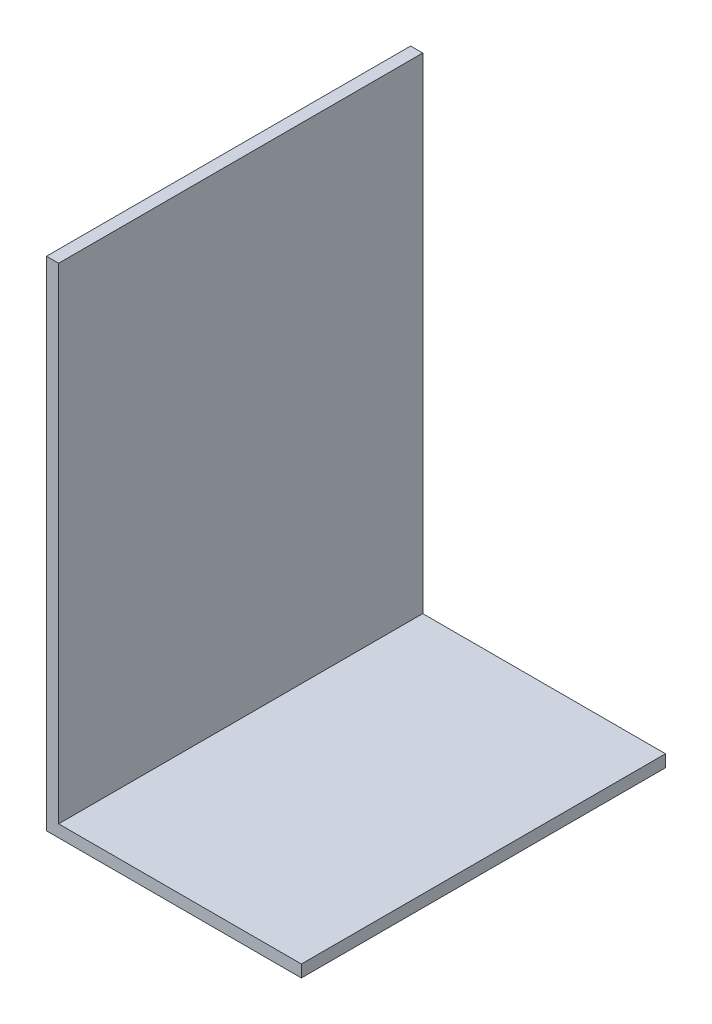
ISO-10303-21;
HEADER;
FILE_DESCRIPTION(('STEP AP214'),'2;1');
FILE_NAME('part.step','',(''),(''),'','','');
FILE_SCHEMA(('AUTOMOTIVE_DESIGN { 1 0 10303 214 1 1 1 1 }'));
ENDSEC;
DATA;
#1=APPLICATION_CONTEXT('core data for automotive mechanical design processes');
#2=APPLICATION_PROTOCOL_DEFINITION('international standard','automotive_design',2000,#1);
#3=PRODUCT_CONTEXT('',#1,'mechanical');
#4=PRODUCT('Part','Part','',(#3));
#5=PRODUCT_RELATED_PRODUCT_CATEGORY('part','',(#4));
#6=PRODUCT_DEFINITION_FORMATION('','',#4);
#7=PRODUCT_DEFINITION_CONTEXT('part definition',#1,'design');
#8=PRODUCT_DEFINITION('design','',#6,#7);
#9=PRODUCT_DEFINITION_SHAPE('','',#8);
#10=(LENGTH_UNIT() NAMED_UNIT(*) SI_UNIT(.MILLI.,.METRE.));
#11=(NAMED_UNIT(*) PLANE_ANGLE_UNIT() SI_UNIT($,.RADIAN.));
#12=(NAMED_UNIT(*) SI_UNIT($,.STERADIAN.) SOLID_ANGLE_UNIT());
#13=UNCERTAINTY_MEASURE_WITH_UNIT(LENGTH_MEASURE(1.E-05),#10,'distance_accuracy_value','');
#14=(GEOMETRIC_REPRESENTATION_CONTEXT(3) GLOBAL_UNCERTAINTY_ASSIGNED_CONTEXT((#13)) GLOBAL_UNIT_ASSIGNED_CONTEXT((#10,
#11,#12)) REPRESENTATION_CONTEXT('',''));
#15=CARTESIAN_POINT('',(0.,0.,0.));
#16=DIRECTION('',(0.,0.,1.));
#17=DIRECTION('',(1.,0.,0.));
#18=AXIS2_PLACEMENT_3D('',#15,#16,#17);
#19=CARTESIAN_POINT('',(0.,-1.,15.));
#20=DIRECTION('',(0.,1.,0.));
#21=DIRECTION('',(0.,0.,1.));
#22=AXIS2_PLACEMENT_3D('',#19,#20,#21);
#23=PLANE('',#22);
#24=DIRECTION('',(1.,0.,0.));
#25=VECTOR('',#24,1.);
#26=CARTESIAN_POINT('',(0.,-1.,-15.));
#27=LINE('',#26,#25);
#28=CARTESIAN_POINT('',(-1.,-1.,-15.));
#29=VERTEX_POINT('',#28);
#30=CARTESIAN_POINT('',(20.,-1.,-15.));
#31=VERTEX_POINT('',#30);
#32=EDGE_CURVE('E114',#29,#31,#27,.T.);
#33=ORIENTED_EDGE('',*,*,#32,.T.);
#34=DIRECTION('',(0.,0.,-1.));
#35=VECTOR('',#34,1.);
#36=CARTESIAN_POINT('',(20.,-1.,15.));
#37=LINE('',#36,#35);
#38=CARTESIAN_POINT('',(20.,-1.,15.));
#39=VERTEX_POINT('',#38);
#40=EDGE_CURVE('E11',#39,#31,#37,.T.);
#41=ORIENTED_EDGE('',*,*,#40,.F.);
#42=DIRECTION('',(1.,0.,0.));
#43=VECTOR('',#42,1.);
#44=CARTESIAN_POINT('',(0.,-1.,15.));
#45=LINE('',#44,#43);
#46=CARTESIAN_POINT('',(-1.,-1.,15.));
#47=VERTEX_POINT('',#46);
#48=EDGE_CURVE('E79',#47,#39,#45,.T.);
#49=ORIENTED_EDGE('',*,*,#48,.F.);
#50=DIRECTION('',(0.,0.,-1.));
#51=VECTOR('',#50,1.);
#52=CARTESIAN_POINT('',(-1.,-1.,15.));
#53=LINE('',#52,#51);
#54=EDGE_CURVE('E110',#47,#29,#53,.T.);
#55=ORIENTED_EDGE('',*,*,#54,.T.);
#56=EDGE_LOOP('',(#33,#41,#49,#55));
#57=FACE_BOUND('',#56,.T.);
#58=ADVANCED_FACE('F33',(#57),#23,.F.);
#59=CARTESIAN_POINT('',(20.,0.,15.));
#60=DIRECTION('',(1.,0.,0.));
#61=DIRECTION('',(0.,0.,-1.));
#62=AXIS2_PLACEMENT_3D('',#59,#60,#61);
#63=PLANE('',#62);
#64=DIRECTION('',(0.,-1.,0.));
#65=VECTOR('',#64,1.);
#66=CARTESIAN_POINT('',(20.,0.,-15.));
#67=LINE('',#66,#65);
#68=CARTESIAN_POINT('',(20.,0.,-15.));
#69=VERTEX_POINT('',#68);
#70=EDGE_CURVE('E117',#69,#31,#67,.T.);
#71=ORIENTED_EDGE('',*,*,#70,.F.);
#72=DIRECTION('',(0.,0.,-1.));
#73=VECTOR('',#72,1.);
#74=CARTESIAN_POINT('',(20.,0.,15.));
#75=LINE('',#74,#73);
#76=CARTESIAN_POINT('',(20.,0.,15.));
#77=VERTEX_POINT('',#76);
#78=EDGE_CURVE('E41',#77,#69,#75,.T.);
#79=ORIENTED_EDGE('',*,*,#78,.F.);
#80=DIRECTION('',(0.,-1.,0.));
#81=VECTOR('',#80,1.);
#82=CARTESIAN_POINT('',(20.,0.,15.));
#83=LINE('',#82,#81);
#84=EDGE_CURVE('E203',#77,#39,#83,.T.);
#85=ORIENTED_EDGE('',*,*,#84,.T.);
#86=ORIENTED_EDGE('',*,*,#40,.T.);
#87=EDGE_LOOP('',(#71,#79,#85,#86));
#88=FACE_BOUND('',#87,.T.);
#89=ADVANCED_FACE('F135',(#88),#63,.T.);
#90=CARTESIAN_POINT('',(0.,0.,15.));
#91=DIRECTION('',(0.,1.,0.));
#92=DIRECTION('',(0.,0.,1.));
#93=AXIS2_PLACEMENT_3D('',#90,#91,#92);
#94=PLANE('',#93);
#95=DIRECTION('',(1.,0.,0.));
#96=VECTOR('',#95,1.);
#97=CARTESIAN_POINT('',(0.,0.,-15.));
#98=LINE('',#97,#96);
#99=CARTESIAN_POINT('',(0.,0.,-15.));
#100=VERTEX_POINT('',#99);
#101=EDGE_CURVE('E120',#100,#69,#98,.T.);
#102=ORIENTED_EDGE('',*,*,#101,.F.);
#103=DIRECTION('',(0.,0.,-1.));
#104=VECTOR('',#103,1.);
#105=CARTESIAN_POINT('',(0.,0.,15.));
#106=LINE('',#105,#104);
#107=CARTESIAN_POINT('',(0.,0.,15.));
#108=VERTEX_POINT('',#107);
#109=EDGE_CURVE('E100',#108,#100,#106,.T.);
#110=ORIENTED_EDGE('',*,*,#109,.F.);
#111=DIRECTION('',(1.,0.,0.));
#112=VECTOR('',#111,1.);
#113=CARTESIAN_POINT('',(0.,0.,15.));
#114=LINE('',#113,#112);
#115=EDGE_CURVE('E106',#108,#77,#114,.T.);
#116=ORIENTED_EDGE('',*,*,#115,.T.);
#117=ORIENTED_EDGE('',*,*,#78,.T.);
#118=EDGE_LOOP('',(#102,#110,#116,#117));
#119=FACE_BOUND('',#118,.T.);
#120=ADVANCED_FACE('F132',(#119),#94,.T.);
#121=CARTESIAN_POINT('',(0.,40.,15.));
#122=DIRECTION('',(1.,0.,0.));
#123=DIRECTION('',(0.,0.,-1.));
#124=AXIS2_PLACEMENT_3D('',#121,#122,#123);
#125=PLANE('',#124);
#126=DIRECTION('',(0.,-1.,0.));
#127=VECTOR('',#126,1.);
#128=CARTESIAN_POINT('',(0.,40.,-15.));
#129=LINE('',#128,#127);
#130=CARTESIAN_POINT('',(0.,40.,-15.));
#131=VERTEX_POINT('',#130);
#132=EDGE_CURVE('E95',#131,#100,#129,.T.);
#133=ORIENTED_EDGE('',*,*,#132,.F.);
#134=DIRECTION('',(0.,0.,-1.));
#135=VECTOR('',#134,1.);
#136=CARTESIAN_POINT('',(0.,40.,15.));
#137=LINE('',#136,#135);
#138=CARTESIAN_POINT('',(0.,40.,15.));
#139=VERTEX_POINT('',#138);
#140=EDGE_CURVE('E90',#139,#131,#137,.T.);
#141=ORIENTED_EDGE('',*,*,#140,.F.);
#142=DIRECTION('',(0.,-1.,0.));
#143=VECTOR('',#142,1.);
#144=CARTESIAN_POINT('',(0.,40.,15.));
#145=LINE('',#144,#143);
#146=EDGE_CURVE('E93',#139,#108,#145,.T.);
#147=ORIENTED_EDGE('',*,*,#146,.T.);
#148=ORIENTED_EDGE('',*,*,#109,.T.);
#149=EDGE_LOOP('',(#133,#141,#147,#148));
#150=FACE_BOUND('',#149,.T.);
#151=ADVANCED_FACE('F92',(#150),#125,.T.);
#152=CARTESIAN_POINT('',(-1.,40.,15.));
#153=DIRECTION('',(0.,1.,0.));
#154=DIRECTION('',(0.,0.,1.));
#155=AXIS2_PLACEMENT_3D('',#152,#153,#154);
#156=PLANE('',#155);
#157=DIRECTION('',(1.,0.,0.));
#158=VECTOR('',#157,1.);
#159=CARTESIAN_POINT('',(-1.,40.,-15.));
#160=LINE('',#159,#158);
#161=CARTESIAN_POINT('',(-1.,40.,-15.));
#162=VERTEX_POINT('',#161);
#163=EDGE_CURVE('E124',#162,#131,#160,.T.);
#164=ORIENTED_EDGE('',*,*,#163,.F.);
#165=DIRECTION('',(0.,0.,-1.));
#166=VECTOR('',#165,1.);
#167=CARTESIAN_POINT('',(-1.,40.,15.));
#168=LINE('',#167,#166);
#169=CARTESIAN_POINT('',(-1.,40.,15.));
#170=VERTEX_POINT('',#169);
#171=EDGE_CURVE('E70',#170,#162,#168,.T.);
#172=ORIENTED_EDGE('',*,*,#171,.F.);
#173=DIRECTION('',(1.,0.,0.));
#174=VECTOR('',#173,1.);
#175=CARTESIAN_POINT('',(-1.,40.,15.));
#176=LINE('',#175,#174);
#177=EDGE_CURVE('E104',#170,#139,#176,.T.);
#178=ORIENTED_EDGE('',*,*,#177,.T.);
#179=ORIENTED_EDGE('',*,*,#140,.T.);
#180=EDGE_LOOP('',(#164,#172,#178,#179));
#181=FACE_BOUND('',#180,.T.);
#182=ADVANCED_FACE('F108',(#181),#156,.T.);
#183=CARTESIAN_POINT('',(-1.,40.,15.));
#184=DIRECTION('',(1.,0.,0.));
#185=DIRECTION('',(0.,0.,-1.));
#186=AXIS2_PLACEMENT_3D('',#183,#184,#185);
#187=PLANE('',#186);
#188=DIRECTION('',(0.,1.,0.));
#189=VECTOR('',#188,1.);
#190=CARTESIAN_POINT('',(-1.,40.,-15.));
#191=LINE('',#190,#189);
#192=EDGE_CURVE('E73',#162,#29,#191,.F.);
#193=ORIENTED_EDGE('',*,*,#192,.T.);
#194=ORIENTED_EDGE('',*,*,#54,.F.);
#195=DIRECTION('',(0.,1.,0.));
#196=VECTOR('',#195,1.);
#197=CARTESIAN_POINT('',(-1.,40.,15.));
#198=LINE('',#197,#196);
#199=EDGE_CURVE('E49',#170,#47,#198,.F.);
#200=ORIENTED_EDGE('',*,*,#199,.F.);
#201=ORIENTED_EDGE('',*,*,#171,.T.);
#202=EDGE_LOOP('',(#193,#194,#200,#201));
#203=FACE_BOUND('',#202,.T.);
#204=ADVANCED_FACE('F140',(#203),#187,.F.);
#205=CARTESIAN_POINT('',(0.,0.,15.));
#206=DIRECTION('',(0.,0.,-1.));
#207=DIRECTION('',(-1.,0.,0.));
#208=AXIS2_PLACEMENT_3D('',#205,#206,#207);
#209=PLANE('',#208);
#210=ORIENTED_EDGE('',*,*,#48,.T.);
#211=ORIENTED_EDGE('',*,*,#84,.F.);
#212=ORIENTED_EDGE('',*,*,#115,.F.);
#213=ORIENTED_EDGE('',*,*,#146,.F.);
#214=ORIENTED_EDGE('',*,*,#177,.F.);
#215=ORIENTED_EDGE('',*,*,#199,.T.);
#216=EDGE_LOOP('',(#210,#211,#212,#213,#214,#215));
#217=FACE_BOUND('',#216,.T.);
#218=ADVANCED_FACE('F103',(#217),#209,.F.);
#219=CARTESIAN_POINT('',(0.,0.,-15.));
#220=DIRECTION('',(0.,0.,-1.));
#221=DIRECTION('',(-1.,0.,0.));
#222=AXIS2_PLACEMENT_3D('',#219,#220,#221);
#223=PLANE('',#222);
#224=ORIENTED_EDGE('',*,*,#32,.F.);
#225=ORIENTED_EDGE('',*,*,#192,.F.);
#226=ORIENTED_EDGE('',*,*,#163,.T.);
#227=ORIENTED_EDGE('',*,*,#132,.T.);
#228=ORIENTED_EDGE('',*,*,#101,.T.);
#229=ORIENTED_EDGE('',*,*,#70,.T.);
#230=EDGE_LOOP('',(#224,#225,#226,#227,#228,#229));
#231=FACE_BOUND('',#230,.T.);
#232=ADVANCED_FACE('F138',(#231),#223,.T.);
#233=CLOSED_SHELL('',(#58,#89,#120,#151,#182,#204,#218,#232));
#234=MANIFOLD_SOLID_BREP('B2',#233);
#235=ADVANCED_BREP_SHAPE_REPRESENTATION('',(#18,#234),#14);
#236=SHAPE_DEFINITION_REPRESENTATION(#9,#235);
ENDSEC;
END-ISO-10303-21;
